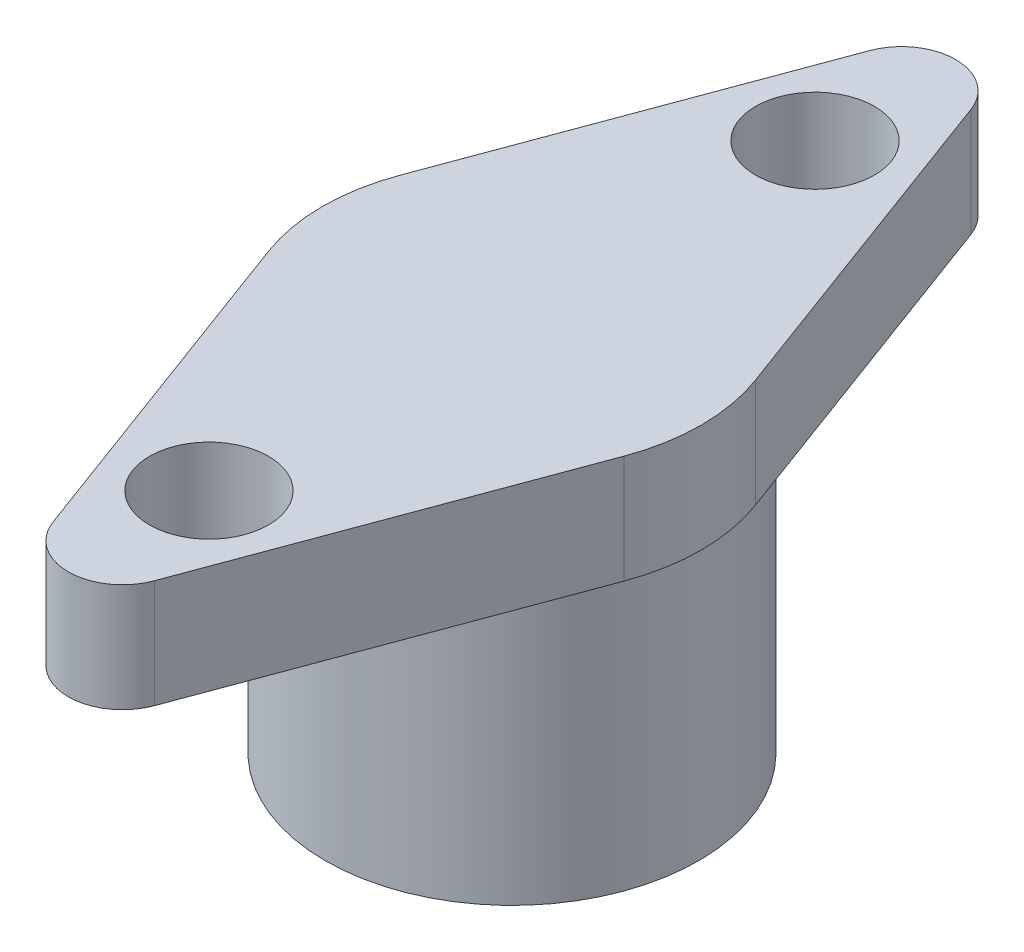
ISO-10303-21;
HEADER;
FILE_DESCRIPTION(('STEP AP214'),'2;1');
FILE_NAME('part.step','',(''),(''),'','','');
FILE_SCHEMA(('AUTOMOTIVE_DESIGN { 1 0 10303 214 1 1 1 1 }'));
ENDSEC;
DATA;
#1=APPLICATION_CONTEXT('core data for automotive mechanical design processes');
#2=APPLICATION_PROTOCOL_DEFINITION('international standard','automotive_design',2000,#1);
#3=PRODUCT_CONTEXT('',#1,'mechanical');
#4=PRODUCT('Part','Part','',(#3));
#5=PRODUCT_RELATED_PRODUCT_CATEGORY('part','',(#4));
#6=PRODUCT_DEFINITION_FORMATION('','',#4);
#7=PRODUCT_DEFINITION_CONTEXT('part definition',#1,'design');
#8=PRODUCT_DEFINITION('design','',#6,#7);
#9=PRODUCT_DEFINITION_SHAPE('','',#8);
#10=(LENGTH_UNIT() NAMED_UNIT(*) SI_UNIT(.MILLI.,.METRE.));
#11=(NAMED_UNIT(*) PLANE_ANGLE_UNIT() SI_UNIT($,.RADIAN.));
#12=(NAMED_UNIT(*) SI_UNIT($,.STERADIAN.) SOLID_ANGLE_UNIT());
#13=UNCERTAINTY_MEASURE_WITH_UNIT(LENGTH_MEASURE(1.E-05),#10,'distance_accuracy_value','');
#14=(GEOMETRIC_REPRESENTATION_CONTEXT(3) GLOBAL_UNCERTAINTY_ASSIGNED_CONTEXT((#13)) GLOBAL_UNIT_ASSIGNED_CONTEXT((#10,
#11,#12)) REPRESENTATION_CONTEXT('',''));
#15=CARTESIAN_POINT('',(0.,0.,0.));
#16=DIRECTION('',(0.,0.,1.));
#17=DIRECTION('',(1.,0.,0.));
#18=AXIS2_PLACEMENT_3D('',#15,#16,#17);
#19=CARTESIAN_POINT('',(0.,0.,0.));
#20=DIRECTION('',(0.,1.,0.));
#21=DIRECTION('',(0.,0.,1.));
#22=AXIS2_PLACEMENT_3D('',#19,#20,#21);
#23=PLANE('',#22);
#24=CARTESIAN_POINT('',(0.,0.,0.));
#25=DIRECTION('',(0.,1.,0.));
#26=DIRECTION('',(0.,0.,1.));
#27=AXIS2_PLACEMENT_3D('',#24,#25,#26);
#28=CIRCLE('',#27,3.45);
#29=CARTESIAN_POINT('',(0.,0.,3.45));
#30=VERTEX_POINT('',#29);
#31=EDGE_CURVE('E37',#30,#30,#28,.T.);
#32=ORIENTED_EDGE('',*,*,#31,.F.);
#33=EDGE_LOOP('',(#32));
#34=FACE_BOUND('',#33,.T.);
#35=CARTESIAN_POINT('',(0.,0.,0.));
#36=DIRECTION('',(0.,1.,0.));
#37=DIRECTION('',(0.,0.,1.));
#38=AXIS2_PLACEMENT_3D('',#35,#36,#37);
#39=CIRCLE('',#38,2.1);
#40=CARTESIAN_POINT('',(0.,0.,2.1));
#41=VERTEX_POINT('',#40);
#42=EDGE_CURVE('E165',#41,#41,#39,.T.);
#43=ORIENTED_EDGE('',*,*,#42,.T.);
#44=EDGE_LOOP('',(#43));
#45=FACE_BOUND('',#44,.T.);
#46=ADVANCED_FACE('F33',(#34,#45),#23,.F.);
#47=CARTESIAN_POINT('',(0.,5.,0.));
#48=DIRECTION('',(0.,-1.,0.));
#49=DIRECTION('',(0.,0.,-1.));
#50=AXIS2_PLACEMENT_3D('',#47,#48,#49);
#51=CYLINDRICAL_SURFACE('',#50,3.45);
#52=CARTESIAN_POINT('',(0.,5.,0.));
#53=DIRECTION('',(0.,1.,0.));
#54=DIRECTION('',(0.,0.,1.));
#55=AXIS2_PLACEMENT_3D('',#52,#53,#54);
#56=CIRCLE('',#55,3.45);
#57=CARTESIAN_POINT('',(0.,5.,3.45));
#58=VERTEX_POINT('',#57);
#59=EDGE_CURVE('E11',#58,#58,#56,.T.);
#60=ORIENTED_EDGE('',*,*,#59,.F.);
#61=EDGE_LOOP('',(#60));
#62=FACE_BOUND('',#61,.T.);
#63=ORIENTED_EDGE('',*,*,#31,.T.);
#64=EDGE_LOOP('',(#63));
#65=FACE_BOUND('',#64,.T.);
#66=ADVANCED_FACE('F35',(#62,#65),#51,.T.);
#67=CARTESIAN_POINT('',(0.,5.,0.));
#68=DIRECTION('',(0.,-1.,0.));
#69=DIRECTION('',(0.,0.,-1.));
#70=AXIS2_PLACEMENT_3D('',#67,#68,#69);
#71=CYLINDRICAL_SURFACE('',#70,2.1);
#72=CARTESIAN_POINT('',(0.,5.,0.));
#73=DIRECTION('',(0.,1.,0.));
#74=DIRECTION('',(0.,0.,1.));
#75=AXIS2_PLACEMENT_3D('',#72,#73,#74);
#76=CIRCLE('',#75,2.1);
#77=CARTESIAN_POINT('',(0.,5.,2.1));
#78=VERTEX_POINT('',#77);
#79=EDGE_CURVE('E162',#78,#78,#76,.T.);
#80=ORIENTED_EDGE('',*,*,#79,.T.);
#81=EDGE_LOOP('',(#80));
#82=FACE_BOUND('',#81,.T.);
#83=ORIENTED_EDGE('',*,*,#42,.F.);
#84=EDGE_LOOP('',(#83));
#85=FACE_BOUND('',#84,.T.);
#86=ADVANCED_FACE('F177',(#82,#85),#71,.F.);
#87=CARTESIAN_POINT('',(0.,5.,0.));
#88=DIRECTION('',(0.,1.,0.));
#89=DIRECTION('',(0.,0.,1.));
#90=AXIS2_PLACEMENT_3D('',#87,#88,#89);
#91=PLANE('',#90);
#92=ORIENTED_EDGE('',*,*,#79,.F.);
#93=EDGE_LOOP('',(#92));
#94=FACE_BOUND('',#93,.T.);
#95=ADVANCED_FACE('F182',(#94),#91,.F.);
#96=CARTESIAN_POINT('',(0.,7.,0.));
#97=DIRECTION('',(0.,1.,0.));
#98=DIRECTION('',(0.,0.,1.));
#99=AXIS2_PLACEMENT_3D('',#96,#97,#98);
#100=PLANE('',#99);
#101=CARTESIAN_POINT('',(0.,7.,-5.6));
#102=DIRECTION('',(0.,1.,0.));
#103=DIRECTION('',(0.,0.,-1.));
#104=AXIS2_PLACEMENT_3D('',#101,#102,#103);
#105=CIRCLE('',#104,1.1);
#106=CARTESIAN_POINT('',(0.,7.,-6.7));
#107=VERTEX_POINT('',#106);
#108=EDGE_CURVE('E136',#107,#107,#105,.T.);
#109=ORIENTED_EDGE('',*,*,#108,.F.);
#110=EDGE_LOOP('',(#109));
#111=FACE_BOUND('',#110,.T.);
#112=CARTESIAN_POINT('',(0.,7.,0.));
#113=DIRECTION('',(0.,1.,0.));
#114=DIRECTION('',(0.,0.,1.));
#115=AXIS2_PLACEMENT_3D('',#112,#113,#114);
#116=CIRCLE('',#115,3.5);
#117=CARTESIAN_POINT('',(-3.28225787327062,7.,-1.21522971217504));
#118=VERTEX_POINT('',#117);
#119=CARTESIAN_POINT('',(-3.28225787327062,7.,1.21522971217504));
#120=VERTEX_POINT('',#119);
#121=EDGE_CURVE('E147',#118,#120,#116,.T.);
#122=ORIENTED_EDGE('',*,*,#121,.T.);
#123=DIRECTION('',(0.34720848919287,0.,0.937787963791605));
#124=VECTOR('',#123,1.);
#125=CARTESIAN_POINT('',(-3.28225787327062,7.,1.21522971217504));
#126=LINE('',#125,#124);
#127=CARTESIAN_POINT('',(-0.937787963791616,7.,7.54749326855284));
#128=VERTEX_POINT('',#127);
#129=EDGE_CURVE('E94',#120,#128,#126,.T.);
#130=ORIENTED_EDGE('',*,*,#129,.T.);
#131=CARTESIAN_POINT('',(0.,7.,7.20028477936));
#132=DIRECTION('',(0.,1.,0.));
#133=DIRECTION('',(0.,0.,1.));
#134=AXIS2_PLACEMENT_3D('',#131,#132,#133);
#135=CIRCLE('',#134,1.);
#136=CARTESIAN_POINT('',(0.937787963791616,7.,7.54749326855284));
#137=VERTEX_POINT('',#136);
#138=EDGE_CURVE('E244',#128,#137,#135,.T.);
#139=ORIENTED_EDGE('',*,*,#138,.T.);
#140=DIRECTION('',(0.34720848919287,0.,-0.937787963791605));
#141=VECTOR('',#140,1.);
#142=CARTESIAN_POINT('',(0.937787963791616,7.,7.54749326855284));
#143=LINE('',#142,#141);
#144=CARTESIAN_POINT('',(3.28225787327062,7.,1.21522971217504));
#145=VERTEX_POINT('',#144);
#146=EDGE_CURVE('E246',#137,#145,#143,.T.);
#147=ORIENTED_EDGE('',*,*,#146,.T.);
#148=CARTESIAN_POINT('',(0.,7.,0.));
#149=DIRECTION('',(0.,1.,0.));
#150=DIRECTION('',(0.,0.,1.));
#151=AXIS2_PLACEMENT_3D('',#148,#149,#150);
#152=CIRCLE('',#151,3.5);
#153=CARTESIAN_POINT('',(3.28225787327062,7.,-1.21522971217504));
#154=VERTEX_POINT('',#153);
#155=EDGE_CURVE('E114',#145,#154,#152,.T.);
#156=ORIENTED_EDGE('',*,*,#155,.T.);
#157=DIRECTION('',(-0.34720848919287,0.,-0.937787963791605));
#158=VECTOR('',#157,1.);
#159=CARTESIAN_POINT('',(0.937787963791616,7.,-7.54749326855284));
#160=LINE('',#159,#158);
#161=CARTESIAN_POINT('',(0.937787963791615,7.,-7.54749326855284));
#162=VERTEX_POINT('',#161);
#163=EDGE_CURVE('E107',#154,#162,#160,.T.);
#164=ORIENTED_EDGE('',*,*,#163,.T.);
#165=CARTESIAN_POINT('',(0.,7.,-7.20028477936));
#166=DIRECTION('',(0.,1.,0.));
#167=DIRECTION('',(0.,0.,-1.));
#168=AXIS2_PLACEMENT_3D('',#165,#166,#167);
#169=CIRCLE('',#168,1.);
#170=CARTESIAN_POINT('',(-0.937787963791616,7.,-7.54749326855284));
#171=VERTEX_POINT('',#170);
#172=EDGE_CURVE('E112',#162,#171,#169,.T.);
#173=ORIENTED_EDGE('',*,*,#172,.T.);
#174=DIRECTION('',(-0.34720848919287,0.,0.937787963791605));
#175=VECTOR('',#174,1.);
#176=CARTESIAN_POINT('',(-3.28225787327062,7.,-1.21522971217504));
#177=LINE('',#176,#175);
#178=EDGE_CURVE('E50',#171,#118,#177,.T.);
#179=ORIENTED_EDGE('',*,*,#178,.T.);
#180=EDGE_LOOP('',(#122,#130,#139,#147,#156,#164,#173,#179));
#181=FACE_BOUND('',#180,.T.);
#182=CARTESIAN_POINT('',(0.,7.,5.6));
#183=DIRECTION('',(0.,1.,0.));
#184=DIRECTION('',(0.,0.,1.));
#185=AXIS2_PLACEMENT_3D('',#182,#183,#184);
#186=CIRCLE('',#185,1.1);
#187=CARTESIAN_POINT('',(0.,7.,6.7));
#188=VERTEX_POINT('',#187);
#189=EDGE_CURVE('E229',#188,#188,#186,.T.);
#190=ORIENTED_EDGE('',*,*,#189,.F.);
#191=EDGE_LOOP('',(#190));
#192=FACE_BOUND('',#191,.T.);
#193=ADVANCED_FACE('F109',(#111,#181,#192),#100,.T.);
#194=ORIENTED_EDGE('',*,*,#59,.T.);
#195=EDGE_LOOP('',(#194));
#196=FACE_BOUND('',#195,.T.);
#197=CARTESIAN_POINT('',(0.,5.,0.));
#198=DIRECTION('',(0.,1.,0.));
#199=DIRECTION('',(0.,0.,1.));
#200=AXIS2_PLACEMENT_3D('',#197,#198,#199);
#201=CIRCLE('',#200,3.5);
#202=CARTESIAN_POINT('',(-3.28225787327062,5.,-1.21522971217504));
#203=VERTEX_POINT('',#202);
#204=CARTESIAN_POINT('',(-3.28225787327062,5.,1.21522971217504));
#205=VERTEX_POINT('',#204);
#206=EDGE_CURVE('E132',#203,#205,#201,.T.);
#207=ORIENTED_EDGE('',*,*,#206,.F.);
#208=DIRECTION('',(-0.34720848919287,0.,0.937787963791605));
#209=VECTOR('',#208,1.);
#210=CARTESIAN_POINT('',(-3.28225787327062,5.,-1.21522971217504));
#211=LINE('',#210,#209);
#212=CARTESIAN_POINT('',(-0.937787963791616,5.,-7.54749326855284));
#213=VERTEX_POINT('',#212);
#214=EDGE_CURVE('E85',#213,#203,#211,.T.);
#215=ORIENTED_EDGE('',*,*,#214,.F.);
#216=CARTESIAN_POINT('',(0.,5.,-7.20028477936));
#217=DIRECTION('',(0.,1.,0.));
#218=DIRECTION('',(0.,0.,-1.));
#219=AXIS2_PLACEMENT_3D('',#216,#217,#218);
#220=CIRCLE('',#219,1.);
#221=CARTESIAN_POINT('',(0.937787963791615,5.,-7.54749326855284));
#222=VERTEX_POINT('',#221);
#223=EDGE_CURVE('E79',#222,#213,#220,.T.);
#224=ORIENTED_EDGE('',*,*,#223,.F.);
#225=DIRECTION('',(-0.34720848919287,0.,-0.937787963791605));
#226=VECTOR('',#225,1.);
#227=CARTESIAN_POINT('',(0.937787963791616,5.,-7.54749326855284));
#228=LINE('',#227,#226);
#229=CARTESIAN_POINT('',(3.28225787327062,5.,-1.21522971217504));
#230=VERTEX_POINT('',#229);
#231=EDGE_CURVE('E122',#230,#222,#228,.T.);
#232=ORIENTED_EDGE('',*,*,#231,.F.);
#233=CARTESIAN_POINT('',(0.,5.,0.));
#234=DIRECTION('',(0.,1.,0.));
#235=DIRECTION('',(0.,0.,1.));
#236=AXIS2_PLACEMENT_3D('',#233,#234,#235);
#237=CIRCLE('',#236,3.5);
#238=CARTESIAN_POINT('',(3.28225787327062,5.,1.21522971217504));
#239=VERTEX_POINT('',#238);
#240=EDGE_CURVE('E142',#239,#230,#237,.T.);
#241=ORIENTED_EDGE('',*,*,#240,.F.);
#242=DIRECTION('',(0.34720848919287,0.,-0.937787963791605));
#243=VECTOR('',#242,1.);
#244=CARTESIAN_POINT('',(0.937787963791616,5.,7.54749326855284));
#245=LINE('',#244,#243);
#246=CARTESIAN_POINT('',(0.937787963791616,5.,7.54749326855284));
#247=VERTEX_POINT('',#246);
#248=EDGE_CURVE('E140',#247,#239,#245,.T.);
#249=ORIENTED_EDGE('',*,*,#248,.F.);
#250=CARTESIAN_POINT('',(0.,5.,7.20028477936));
#251=DIRECTION('',(0.,1.,0.));
#252=DIRECTION('',(0.,0.,1.));
#253=AXIS2_PLACEMENT_3D('',#250,#251,#252);
#254=CIRCLE('',#253,1.);
#255=CARTESIAN_POINT('',(-0.937787963791616,5.,7.54749326855284));
#256=VERTEX_POINT('',#255);
#257=EDGE_CURVE('E138',#256,#247,#254,.T.);
#258=ORIENTED_EDGE('',*,*,#257,.F.);
#259=DIRECTION('',(0.34720848919287,0.,0.937787963791605));
#260=VECTOR('',#259,1.);
#261=CARTESIAN_POINT('',(-3.28225787327062,5.,1.21522971217504));
#262=LINE('',#261,#260);
#263=EDGE_CURVE('E135',#205,#256,#262,.T.);
#264=ORIENTED_EDGE('',*,*,#263,.F.);
#265=EDGE_LOOP('',(#207,#215,#224,#232,#241,#249,#258,#264));
#266=FACE_BOUND('',#265,.T.);
#267=CARTESIAN_POINT('',(0.,5.,-5.6));
#268=DIRECTION('',(0.,1.,0.));
#269=DIRECTION('',(0.,0.,-1.));
#270=AXIS2_PLACEMENT_3D('',#267,#268,#269);
#271=CIRCLE('',#270,1.1);
#272=CARTESIAN_POINT('',(0.,5.,-6.7));
#273=VERTEX_POINT('',#272);
#274=EDGE_CURVE('E235',#273,#273,#271,.T.);
#275=ORIENTED_EDGE('',*,*,#274,.T.);
#276=EDGE_LOOP('',(#275));
#277=FACE_BOUND('',#276,.T.);
#278=CARTESIAN_POINT('',(0.,5.,5.6));
#279=DIRECTION('',(0.,1.,0.));
#280=DIRECTION('',(0.,0.,1.));
#281=AXIS2_PLACEMENT_3D('',#278,#279,#280);
#282=CIRCLE('',#281,1.1);
#283=CARTESIAN_POINT('',(0.,5.,6.7));
#284=VERTEX_POINT('',#283);
#285=EDGE_CURVE('E232',#284,#284,#282,.T.);
#286=ORIENTED_EDGE('',*,*,#285,.T.);
#287=EDGE_LOOP('',(#286));
#288=FACE_BOUND('',#287,.T.);
#289=ADVANCED_FACE('F188',(#196,#266,#277,#288),#91,.F.);
#290=CARTESIAN_POINT('',(0.,7.,0.));
#291=DIRECTION('',(0.,-1.,0.));
#292=DIRECTION('',(0.,0.,-1.));
#293=AXIS2_PLACEMENT_3D('',#290,#291,#292);
#294=CYLINDRICAL_SURFACE('',#293,3.5);
#295=ORIENTED_EDGE('',*,*,#206,.T.);
#296=DIRECTION('',(0.,-1.,0.));
#297=VECTOR('',#296,1.);
#298=CARTESIAN_POINT('',(-3.28225787327062,7.,1.21522971217504));
#299=LINE('',#298,#297);
#300=EDGE_CURVE('E160',#120,#205,#299,.T.);
#301=ORIENTED_EDGE('',*,*,#300,.F.);
#302=ORIENTED_EDGE('',*,*,#121,.F.);
#303=DIRECTION('',(0.,-1.,0.));
#304=VECTOR('',#303,1.);
#305=CARTESIAN_POINT('',(-3.28225787327062,7.,-1.21522971217504));
#306=LINE('',#305,#304);
#307=EDGE_CURVE('E128',#118,#203,#306,.T.);
#308=ORIENTED_EDGE('',*,*,#307,.T.);
#309=EDGE_LOOP('',(#295,#301,#302,#308));
#310=FACE_BOUND('',#309,.T.);
#311=ADVANCED_FACE('F184',(#310),#294,.T.);
#312=CARTESIAN_POINT('',(-3.28225787327062,7.,1.21522971217504));
#313=DIRECTION('',(0.937787963791605,0.,-0.34720848919287));
#314=DIRECTION('',(-0.34720848919287,0.,-0.937787963791605));
#315=AXIS2_PLACEMENT_3D('',#312,#313,#314);
#316=PLANE('',#315);
#317=ORIENTED_EDGE('',*,*,#263,.T.);
#318=DIRECTION('',(0.,-1.,0.));
#319=VECTOR('',#318,1.);
#320=CARTESIAN_POINT('',(-0.937787963791616,7.,7.54749326855284));
#321=LINE('',#320,#319);
#322=EDGE_CURVE('E157',#128,#256,#321,.T.);
#323=ORIENTED_EDGE('',*,*,#322,.F.);
#324=ORIENTED_EDGE('',*,*,#129,.F.);
#325=ORIENTED_EDGE('',*,*,#300,.T.);
#326=EDGE_LOOP('',(#317,#323,#324,#325));
#327=FACE_BOUND('',#326,.T.);
#328=ADVANCED_FACE('F187',(#327),#316,.F.);
#329=CARTESIAN_POINT('',(0.,7.,7.20028477936));
#330=DIRECTION('',(0.,-1.,0.));
#331=DIRECTION('',(0.,0.,-1.));
#332=AXIS2_PLACEMENT_3D('',#329,#330,#331);
#333=CYLINDRICAL_SURFACE('',#332,1.);
#334=ORIENTED_EDGE('',*,*,#257,.T.);
#335=DIRECTION('',(0.,-1.,0.));
#336=VECTOR('',#335,1.);
#337=CARTESIAN_POINT('',(0.937787963791616,7.,7.54749326855284));
#338=LINE('',#337,#336);
#339=EDGE_CURVE('E154',#137,#247,#338,.T.);
#340=ORIENTED_EDGE('',*,*,#339,.F.);
#341=ORIENTED_EDGE('',*,*,#138,.F.);
#342=ORIENTED_EDGE('',*,*,#322,.T.);
#343=EDGE_LOOP('',(#334,#340,#341,#342));
#344=FACE_BOUND('',#343,.T.);
#345=ADVANCED_FACE('F192',(#344),#333,.T.);
#346=CARTESIAN_POINT('',(0.937787963791616,7.,7.54749326855284));
#347=DIRECTION('',(-0.937787963791605,0.,-0.34720848919287));
#348=DIRECTION('',(-0.34720848919287,0.,0.937787963791605));
#349=AXIS2_PLACEMENT_3D('',#346,#347,#348);
#350=PLANE('',#349);
#351=ORIENTED_EDGE('',*,*,#248,.T.);
#352=DIRECTION('',(0.,-1.,0.));
#353=VECTOR('',#352,1.);
#354=CARTESIAN_POINT('',(3.28225787327062,7.,1.21522971217504));
#355=LINE('',#354,#353);
#356=EDGE_CURVE('E151',#145,#239,#355,.T.);
#357=ORIENTED_EDGE('',*,*,#356,.F.);
#358=ORIENTED_EDGE('',*,*,#146,.F.);
#359=ORIENTED_EDGE('',*,*,#339,.T.);
#360=EDGE_LOOP('',(#351,#357,#358,#359));
#361=FACE_BOUND('',#360,.T.);
#362=ADVANCED_FACE('F195',(#361),#350,.F.);
#363=CARTESIAN_POINT('',(0.,7.,0.));
#364=DIRECTION('',(0.,-1.,0.));
#365=DIRECTION('',(0.,0.,-1.));
#366=AXIS2_PLACEMENT_3D('',#363,#364,#365);
#367=CYLINDRICAL_SURFACE('',#366,3.5);
#368=ORIENTED_EDGE('',*,*,#240,.T.);
#369=DIRECTION('',(0.,-1.,0.));
#370=VECTOR('',#369,1.);
#371=CARTESIAN_POINT('',(3.28225787327062,7.,-1.21522971217504));
#372=LINE('',#371,#370);
#373=EDGE_CURVE('E123',#154,#230,#372,.T.);
#374=ORIENTED_EDGE('',*,*,#373,.F.);
#375=ORIENTED_EDGE('',*,*,#155,.F.);
#376=ORIENTED_EDGE('',*,*,#356,.T.);
#377=EDGE_LOOP('',(#368,#374,#375,#376));
#378=FACE_BOUND('',#377,.T.);
#379=ADVANCED_FACE('F199',(#378),#367,.T.);
#380=CARTESIAN_POINT('',(0.937787963791616,7.,-7.54749326855284));
#381=DIRECTION('',(-0.937787963791605,0.,0.34720848919287));
#382=DIRECTION('',(0.34720848919287,0.,0.937787963791605));
#383=AXIS2_PLACEMENT_3D('',#380,#381,#382);
#384=PLANE('',#383);
#385=ORIENTED_EDGE('',*,*,#231,.T.);
#386=DIRECTION('',(0.,-1.,0.));
#387=VECTOR('',#386,1.);
#388=CARTESIAN_POINT('',(0.937787963791615,7.,-7.54749326855284));
#389=LINE('',#388,#387);
#390=EDGE_CURVE('E119',#162,#222,#389,.T.);
#391=ORIENTED_EDGE('',*,*,#390,.F.);
#392=ORIENTED_EDGE('',*,*,#163,.F.);
#393=ORIENTED_EDGE('',*,*,#373,.T.);
#394=EDGE_LOOP('',(#385,#391,#392,#393));
#395=FACE_BOUND('',#394,.T.);
#396=ADVANCED_FACE('F120',(#395),#384,.F.);
#397=CARTESIAN_POINT('',(0.,7.,-7.20028477936));
#398=DIRECTION('',(0.,-1.,0.));
#399=DIRECTION('',(0.,0.,-1.));
#400=AXIS2_PLACEMENT_3D('',#397,#398,#399);
#401=CYLINDRICAL_SURFACE('',#400,1.);
#402=ORIENTED_EDGE('',*,*,#223,.T.);
#403=DIRECTION('',(0.,-1.,0.));
#404=VECTOR('',#403,1.);
#405=CARTESIAN_POINT('',(-0.937787963791616,7.,-7.54749326855284));
#406=LINE('',#405,#404);
#407=EDGE_CURVE('E124',#171,#213,#406,.T.);
#408=ORIENTED_EDGE('',*,*,#407,.F.);
#409=ORIENTED_EDGE('',*,*,#172,.F.);
#410=ORIENTED_EDGE('',*,*,#390,.T.);
#411=EDGE_LOOP('',(#402,#408,#409,#410));
#412=FACE_BOUND('',#411,.T.);
#413=ADVANCED_FACE('F126',(#412),#401,.T.);
#414=CARTESIAN_POINT('',(-3.28225787327062,7.,-1.21522971217504));
#415=DIRECTION('',(0.937787963791605,0.,0.34720848919287));
#416=DIRECTION('',(0.34720848919287,0.,-0.937787963791605));
#417=AXIS2_PLACEMENT_3D('',#414,#415,#416);
#418=PLANE('',#417);
#419=ORIENTED_EDGE('',*,*,#214,.T.);
#420=ORIENTED_EDGE('',*,*,#307,.F.);
#421=ORIENTED_EDGE('',*,*,#178,.F.);
#422=ORIENTED_EDGE('',*,*,#407,.T.);
#423=EDGE_LOOP('',(#419,#420,#421,#422));
#424=FACE_BOUND('',#423,.T.);
#425=ADVANCED_FACE('F208',(#424),#418,.F.);
#426=CARTESIAN_POINT('',(0.,7.,-5.6));
#427=DIRECTION('',(0.,-1.,0.));
#428=DIRECTION('',(0.,0.,-1.));
#429=AXIS2_PLACEMENT_3D('',#426,#427,#428);
#430=CYLINDRICAL_SURFACE('',#429,1.1);
#431=ORIENTED_EDGE('',*,*,#108,.T.);
#432=EDGE_LOOP('',(#431));
#433=FACE_BOUND('',#432,.T.);
#434=ORIENTED_EDGE('',*,*,#274,.F.);
#435=EDGE_LOOP('',(#434));
#436=FACE_BOUND('',#435,.T.);
#437=ADVANCED_FACE('F211',(#433,#436),#430,.F.);
#438=CARTESIAN_POINT('',(0.,7.,5.6));
#439=DIRECTION('',(0.,-1.,0.));
#440=DIRECTION('',(0.,0.,-1.));
#441=AXIS2_PLACEMENT_3D('',#438,#439,#440);
#442=CYLINDRICAL_SURFACE('',#441,1.1);
#443=ORIENTED_EDGE('',*,*,#189,.T.);
#444=EDGE_LOOP('',(#443));
#445=FACE_BOUND('',#444,.T.);
#446=ORIENTED_EDGE('',*,*,#285,.F.);
#447=EDGE_LOOP('',(#446));
#448=FACE_BOUND('',#447,.T.);
#449=ADVANCED_FACE('F220',(#445,#448),#442,.F.);
#450=CLOSED_SHELL('',(#46,#66,#86,#95,#193,#289,#311,#328,#345,#362,#379,#396,#413,#425,#437,#449));
#451=MANIFOLD_SOLID_BREP('B2',#450);
#452=ADVANCED_BREP_SHAPE_REPRESENTATION('',(#18,#451),#14);
#453=SHAPE_DEFINITION_REPRESENTATION(#9,#452);
ENDSEC;
END-ISO-10303-21;
